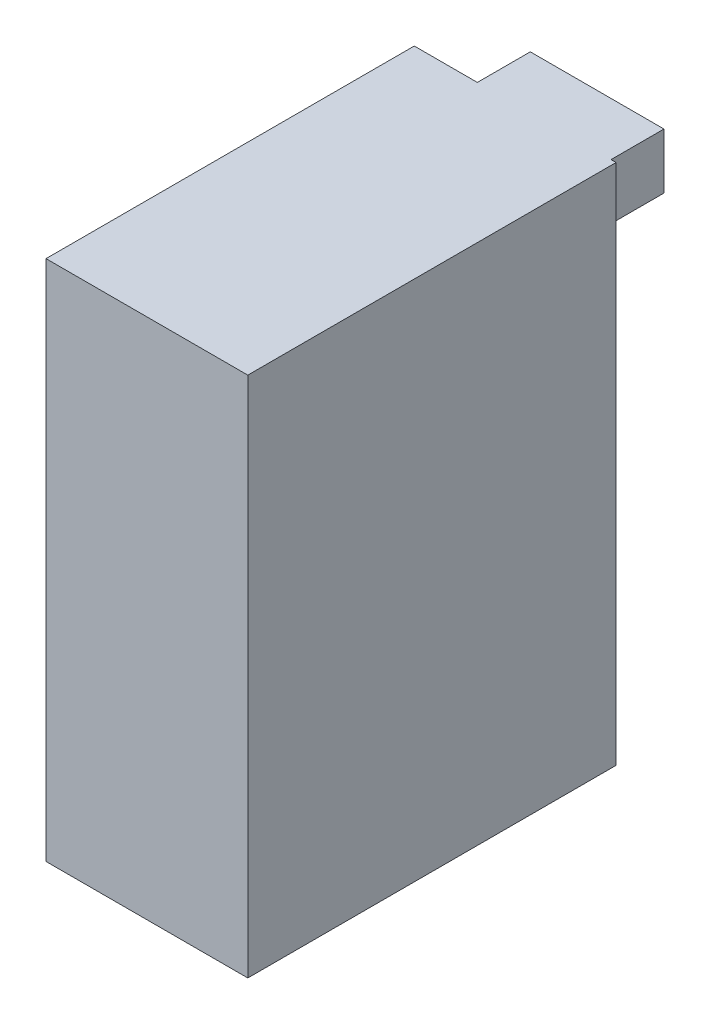
ISO-10303-21;
HEADER;
FILE_DESCRIPTION(('STEP AP214'),'2;1');
FILE_NAME('part.step','',(''),(''),'','','');
FILE_SCHEMA(('AUTOMOTIVE_DESIGN { 1 0 10303 214 1 1 1 1 }'));
ENDSEC;
DATA;
#1=APPLICATION_CONTEXT('core data for automotive mechanical design processes');
#2=APPLICATION_PROTOCOL_DEFINITION('international standard','automotive_design',2000,#1);
#3=PRODUCT_CONTEXT('',#1,'mechanical');
#4=PRODUCT('Part','Part','',(#3));
#5=PRODUCT_RELATED_PRODUCT_CATEGORY('part','',(#4));
#6=PRODUCT_DEFINITION_FORMATION('','',#4);
#7=PRODUCT_DEFINITION_CONTEXT('part definition',#1,'design');
#8=PRODUCT_DEFINITION('design','',#6,#7);
#9=PRODUCT_DEFINITION_SHAPE('','',#8);
#10=(LENGTH_UNIT() NAMED_UNIT(*) SI_UNIT(.MILLI.,.METRE.));
#11=(NAMED_UNIT(*) PLANE_ANGLE_UNIT() SI_UNIT($,.RADIAN.));
#12=(NAMED_UNIT(*) SI_UNIT($,.STERADIAN.) SOLID_ANGLE_UNIT());
#13=UNCERTAINTY_MEASURE_WITH_UNIT(LENGTH_MEASURE(1.E-05),#10,'distance_accuracy_value','');
#14=(GEOMETRIC_REPRESENTATION_CONTEXT(3) GLOBAL_UNCERTAINTY_ASSIGNED_CONTEXT((#13)) GLOBAL_UNIT_ASSIGNED_CONTEXT((#10,
#11,#12)) REPRESENTATION_CONTEXT('',''));
#15=CARTESIAN_POINT('',(0.,0.,0.));
#16=DIRECTION('',(0.,0.,1.));
#17=DIRECTION('',(1.,0.,0.));
#18=AXIS2_PLACEMENT_3D('',#15,#16,#17);
#19=CARTESIAN_POINT('',(-20.,51.75,-36.5));
#20=DIRECTION('',(0.,0.,1.));
#21=DIRECTION('',(1.,0.,0.));
#22=AXIS2_PLACEMENT_3D('',#19,#20,#21);
#23=PLANE('',#22);
#24=DIRECTION('',(0.,-1.,0.));
#25=VECTOR('',#24,1.);
#26=CARTESIAN_POINT('',(19.,51.75,-36.5));
#27=LINE('',#26,#25);
#28=CARTESIAN_POINT('',(19.,51.75,-36.5));
#29=VERTEX_POINT('',#28);
#30=CARTESIAN_POINT('',(19.,40.75,-36.5));
#31=VERTEX_POINT('',#30);
#32=EDGE_CURVE('E138',#29,#31,#27,.T.);
#33=ORIENTED_EDGE('',*,*,#32,.F.);
#34=DIRECTION('',(-1.,0.,0.));
#35=VECTOR('',#34,1.);
#36=CARTESIAN_POINT('',(-20.,51.75,-36.5));
#37=LINE('',#36,#35);
#38=CARTESIAN_POINT('',(20.,51.75,-36.5));
#39=VERTEX_POINT('',#38);
#40=EDGE_CURVE('E160',#39,#29,#37,.T.);
#41=ORIENTED_EDGE('',*,*,#40,.F.);
#42=DIRECTION('',(0.,-1.,0.));
#43=VECTOR('',#42,1.);
#44=CARTESIAN_POINT('',(20.,51.75,-36.5));
#45=LINE('',#44,#43);
#46=CARTESIAN_POINT('',(20.,-51.75,-36.5));
#47=VERTEX_POINT('',#46);
#48=EDGE_CURVE('E12',#39,#47,#45,.T.);
#49=ORIENTED_EDGE('',*,*,#48,.T.);
#50=DIRECTION('',(-1.,0.,0.));
#51=VECTOR('',#50,1.);
#52=CARTESIAN_POINT('',(-20.,-51.75,-36.5));
#53=LINE('',#52,#51);
#54=CARTESIAN_POINT('',(-20.,-51.75,-36.5));
#55=VERTEX_POINT('',#54);
#56=EDGE_CURVE('E142',#47,#55,#53,.T.);
#57=ORIENTED_EDGE('',*,*,#56,.T.);
#58=DIRECTION('',(0.,-1.,0.));
#59=VECTOR('',#58,1.);
#60=CARTESIAN_POINT('',(-20.,51.75,-36.5));
#61=LINE('',#60,#59);
#62=CARTESIAN_POINT('',(-20.,51.75,-36.5));
#63=VERTEX_POINT('',#62);
#64=EDGE_CURVE('E59',#63,#55,#61,.T.);
#65=ORIENTED_EDGE('',*,*,#64,.F.);
#66=CARTESIAN_POINT('',(-7.5,51.75,-36.5));
#67=VERTEX_POINT('',#66);
#68=EDGE_CURVE('E73',#67,#63,#37,.T.);
#69=ORIENTED_EDGE('',*,*,#68,.F.);
#70=DIRECTION('',(0.,1.,0.));
#71=VECTOR('',#70,1.);
#72=CARTESIAN_POINT('',(-7.5,51.75,-36.5));
#73=LINE('',#72,#71);
#74=CARTESIAN_POINT('',(-7.5,40.75,-36.5));
#75=VERTEX_POINT('',#74);
#76=EDGE_CURVE('E135',#75,#67,#73,.T.);
#77=ORIENTED_EDGE('',*,*,#76,.F.);
#78=DIRECTION('',(-1.,0.,0.));
#79=VECTOR('',#78,1.);
#80=CARTESIAN_POINT('',(19.,40.75,-36.5));
#81=LINE('',#80,#79);
#82=EDGE_CURVE('E67',#31,#75,#81,.T.);
#83=ORIENTED_EDGE('',*,*,#82,.F.);
#84=EDGE_LOOP('',(#33,#41,#49,#57,#65,#69,#77,#83));
#85=FACE_BOUND('',#84,.T.);
#86=ADVANCED_FACE('F50',(#85),#23,.F.);
#87=CARTESIAN_POINT('',(20.,51.75,36.5));
#88=DIRECTION('',(-1.,0.,0.));
#89=DIRECTION('',(0.,0.,1.));
#90=AXIS2_PLACEMENT_3D('',#87,#88,#89);
#91=PLANE('',#90);
#92=DIRECTION('',(0.,0.,-1.));
#93=VECTOR('',#92,1.);
#94=CARTESIAN_POINT('',(20.,-51.75,36.5));
#95=LINE('',#94,#93);
#96=CARTESIAN_POINT('',(20.,-51.75,36.5));
#97=VERTEX_POINT('',#96);
#98=EDGE_CURVE('E139',#97,#47,#95,.T.);
#99=ORIENTED_EDGE('',*,*,#98,.T.);
#100=ORIENTED_EDGE('',*,*,#48,.F.);
#101=DIRECTION('',(0.,0.,-1.));
#102=VECTOR('',#101,1.);
#103=CARTESIAN_POINT('',(20.,51.75,36.5));
#104=LINE('',#103,#102);
#105=CARTESIAN_POINT('',(20.,51.75,36.5));
#106=VERTEX_POINT('',#105);
#107=EDGE_CURVE('E148',#106,#39,#104,.T.);
#108=ORIENTED_EDGE('',*,*,#107,.F.);
#109=DIRECTION('',(0.,-1.,0.));
#110=VECTOR('',#109,1.);
#111=CARTESIAN_POINT('',(20.,51.75,36.5));
#112=LINE('',#111,#110);
#113=EDGE_CURVE('E168',#106,#97,#112,.T.);
#114=ORIENTED_EDGE('',*,*,#113,.T.);
#115=EDGE_LOOP('',(#99,#100,#108,#114));
#116=FACE_BOUND('',#115,.T.);
#117=ADVANCED_FACE('F52',(#116),#91,.F.);
#118=CARTESIAN_POINT('',(-20.,51.75,36.5));
#119=DIRECTION('',(1.,0.,0.));
#120=DIRECTION('',(0.,0.,-1.));
#121=AXIS2_PLACEMENT_3D('',#118,#119,#120);
#122=PLANE('',#121);
#123=DIRECTION('',(0.,0.,1.));
#124=VECTOR('',#123,1.);
#125=CARTESIAN_POINT('',(-20.,-51.75,36.5));
#126=LINE('',#125,#124);
#127=CARTESIAN_POINT('',(-20.,-51.75,36.5));
#128=VERTEX_POINT('',#127);
#129=EDGE_CURVE('E173',#55,#128,#126,.T.);
#130=ORIENTED_EDGE('',*,*,#129,.T.);
#131=DIRECTION('',(0.,-1.,0.));
#132=VECTOR('',#131,1.);
#133=CARTESIAN_POINT('',(-20.,51.75,36.5));
#134=LINE('',#133,#132);
#135=CARTESIAN_POINT('',(-20.,51.75,36.5));
#136=VERTEX_POINT('',#135);
#137=EDGE_CURVE('E165',#136,#128,#134,.T.);
#138=ORIENTED_EDGE('',*,*,#137,.F.);
#139=DIRECTION('',(0.,0.,1.));
#140=VECTOR('',#139,1.);
#141=CARTESIAN_POINT('',(-20.,51.75,36.5));
#142=LINE('',#141,#140);
#143=EDGE_CURVE('E154',#63,#136,#142,.T.);
#144=ORIENTED_EDGE('',*,*,#143,.F.);
#145=ORIENTED_EDGE('',*,*,#64,.T.);
#146=EDGE_LOOP('',(#130,#138,#144,#145));
#147=FACE_BOUND('',#146,.T.);
#148=ADVANCED_FACE('F183',(#147),#122,.F.);
#149=CARTESIAN_POINT('',(-20.,51.75,36.5));
#150=DIRECTION('',(0.,0.,-1.));
#151=DIRECTION('',(-1.,0.,0.));
#152=AXIS2_PLACEMENT_3D('',#149,#150,#151);
#153=PLANE('',#152);
#154=DIRECTION('',(1.,0.,0.));
#155=VECTOR('',#154,1.);
#156=CARTESIAN_POINT('',(-20.,-51.75,36.5));
#157=LINE('',#156,#155);
#158=EDGE_CURVE('E151',#128,#97,#157,.T.);
#159=ORIENTED_EDGE('',*,*,#158,.T.);
#160=ORIENTED_EDGE('',*,*,#113,.F.);
#161=DIRECTION('',(1.,0.,0.));
#162=VECTOR('',#161,1.);
#163=CARTESIAN_POINT('',(-20.,51.75,36.5));
#164=LINE('',#163,#162);
#165=EDGE_CURVE('E171',#136,#106,#164,.T.);
#166=ORIENTED_EDGE('',*,*,#165,.F.);
#167=ORIENTED_EDGE('',*,*,#137,.T.);
#168=EDGE_LOOP('',(#159,#160,#166,#167));
#169=FACE_BOUND('',#168,.T.);
#170=ADVANCED_FACE('F187',(#169),#153,.F.);
#171=CARTESIAN_POINT('',(0.,51.75,0.));
#172=DIRECTION('',(0.,-1.,0.));
#173=DIRECTION('',(0.,0.,-1.));
#174=AXIS2_PLACEMENT_3D('',#171,#172,#173);
#175=PLANE('',#174);
#176=ORIENTED_EDGE('',*,*,#107,.T.);
#177=ORIENTED_EDGE('',*,*,#40,.T.);
#178=DIRECTION('',(0.,0.,1.));
#179=VECTOR('',#178,1.);
#180=CARTESIAN_POINT('',(19.,51.75,-47.));
#181=LINE('',#180,#179);
#182=CARTESIAN_POINT('',(19.,51.75,-47.));
#183=VERTEX_POINT('',#182);
#184=EDGE_CURVE('E192',#183,#29,#181,.T.);
#185=ORIENTED_EDGE('',*,*,#184,.F.);
#186=DIRECTION('',(1.,0.,0.));
#187=VECTOR('',#186,1.);
#188=CARTESIAN_POINT('',(19.,51.75,-47.));
#189=LINE('',#188,#187);
#190=CARTESIAN_POINT('',(-7.5,51.75,-47.));
#191=VERTEX_POINT('',#190);
#192=EDGE_CURVE('E131',#191,#183,#189,.T.);
#193=ORIENTED_EDGE('',*,*,#192,.F.);
#194=DIRECTION('',(0.,0.,1.));
#195=VECTOR('',#194,1.);
#196=CARTESIAN_POINT('',(-7.5,51.75,-47.));
#197=LINE('',#196,#195);
#198=EDGE_CURVE('E144',#191,#67,#197,.T.);
#199=ORIENTED_EDGE('',*,*,#198,.T.);
#200=ORIENTED_EDGE('',*,*,#68,.T.);
#201=ORIENTED_EDGE('',*,*,#143,.T.);
#202=ORIENTED_EDGE('',*,*,#165,.T.);
#203=EDGE_LOOP('',(#176,#177,#185,#193,#199,#200,#201,#202));
#204=FACE_BOUND('',#203,.T.);
#205=ADVANCED_FACE('F180',(#204),#175,.F.);
#206=CARTESIAN_POINT('',(0.,-51.75,0.));
#207=DIRECTION('',(0.,-1.,0.));
#208=DIRECTION('',(0.,0.,-1.));
#209=AXIS2_PLACEMENT_3D('',#206,#207,#208);
#210=PLANE('',#209);
#211=ORIENTED_EDGE('',*,*,#98,.F.);
#212=ORIENTED_EDGE('',*,*,#158,.F.);
#213=ORIENTED_EDGE('',*,*,#129,.F.);
#214=ORIENTED_EDGE('',*,*,#56,.F.);
#215=EDGE_LOOP('',(#211,#212,#213,#214));
#216=FACE_BOUND('',#215,.T.);
#217=ADVANCED_FACE('F215',(#216),#210,.T.);
#218=CARTESIAN_POINT('',(19.,51.75,-47.));
#219=DIRECTION('',(-1.,0.,0.));
#220=DIRECTION('',(0.,-1.,0.));
#221=AXIS2_PLACEMENT_3D('',#218,#219,#220);
#222=PLANE('',#221);
#223=ORIENTED_EDGE('',*,*,#32,.T.);
#224=DIRECTION('',(0.,0.,1.));
#225=VECTOR('',#224,1.);
#226=CARTESIAN_POINT('',(19.,40.75,-47.));
#227=LINE('',#226,#225);
#228=CARTESIAN_POINT('',(19.,40.75,-47.));
#229=VERTEX_POINT('',#228);
#230=EDGE_CURVE('E119',#229,#31,#227,.T.);
#231=ORIENTED_EDGE('',*,*,#230,.F.);
#232=DIRECTION('',(0.,-1.,0.));
#233=VECTOR('',#232,1.);
#234=CARTESIAN_POINT('',(19.,51.75,-47.));
#235=LINE('',#234,#233);
#236=EDGE_CURVE('E126',#183,#229,#235,.T.);
#237=ORIENTED_EDGE('',*,*,#236,.F.);
#238=ORIENTED_EDGE('',*,*,#184,.T.);
#239=EDGE_LOOP('',(#223,#231,#237,#238));
#240=FACE_BOUND('',#239,.T.);
#241=ADVANCED_FACE('F137',(#240),#222,.F.);
#242=CARTESIAN_POINT('',(19.,40.75,-47.));
#243=DIRECTION('',(0.,1.,0.));
#244=DIRECTION('',(-1.,0.,0.));
#245=AXIS2_PLACEMENT_3D('',#242,#243,#244);
#246=PLANE('',#245);
#247=ORIENTED_EDGE('',*,*,#82,.T.);
#248=DIRECTION('',(0.,0.,1.));
#249=VECTOR('',#248,1.);
#250=CARTESIAN_POINT('',(-7.5,40.75,-47.));
#251=LINE('',#250,#249);
#252=CARTESIAN_POINT('',(-7.5,40.75,-47.));
#253=VERTEX_POINT('',#252);
#254=EDGE_CURVE('E122',#253,#75,#251,.T.);
#255=ORIENTED_EDGE('',*,*,#254,.F.);
#256=DIRECTION('',(-1.,0.,0.));
#257=VECTOR('',#256,1.);
#258=CARTESIAN_POINT('',(19.,40.75,-47.));
#259=LINE('',#258,#257);
#260=EDGE_CURVE('E115',#229,#253,#259,.T.);
#261=ORIENTED_EDGE('',*,*,#260,.F.);
#262=ORIENTED_EDGE('',*,*,#230,.T.);
#263=EDGE_LOOP('',(#247,#255,#261,#262));
#264=FACE_BOUND('',#263,.T.);
#265=ADVANCED_FACE('F117',(#264),#246,.F.);
#266=CARTESIAN_POINT('',(-7.5,51.75,-47.));
#267=DIRECTION('',(1.,0.,0.));
#268=DIRECTION('',(0.,1.,0.));
#269=AXIS2_PLACEMENT_3D('',#266,#267,#268);
#270=PLANE('',#269);
#271=ORIENTED_EDGE('',*,*,#76,.T.);
#272=ORIENTED_EDGE('',*,*,#198,.F.);
#273=DIRECTION('',(0.,1.,0.));
#274=VECTOR('',#273,1.);
#275=CARTESIAN_POINT('',(-7.5,51.75,-47.));
#276=LINE('',#275,#274);
#277=EDGE_CURVE('E125',#253,#191,#276,.T.);
#278=ORIENTED_EDGE('',*,*,#277,.F.);
#279=ORIENTED_EDGE('',*,*,#254,.T.);
#280=EDGE_LOOP('',(#271,#272,#278,#279));
#281=FACE_BOUND('',#280,.T.);
#282=ADVANCED_FACE('F205',(#281),#270,.F.);
#283=CARTESIAN_POINT('',(0.,0.,-47.));
#284=DIRECTION('',(0.,0.,-1.));
#285=DIRECTION('',(-1.,0.,0.));
#286=AXIS2_PLACEMENT_3D('',#283,#284,#285);
#287=PLANE('',#286);
#288=ORIENTED_EDGE('',*,*,#236,.T.);
#289=ORIENTED_EDGE('',*,*,#260,.T.);
#290=ORIENTED_EDGE('',*,*,#277,.T.);
#291=ORIENTED_EDGE('',*,*,#192,.T.);
#292=EDGE_LOOP('',(#288,#289,#290,#291));
#293=FACE_BOUND('',#292,.T.);
#294=ADVANCED_FACE('F129',(#293),#287,.T.);
#295=CLOSED_SHELL('',(#86,#117,#148,#170,#205,#217,#241,#265,#282,#294));
#296=MANIFOLD_SOLID_BREP('B2',#295);
#297=ADVANCED_BREP_SHAPE_REPRESENTATION('',(#18,#296),#14);
#298=SHAPE_DEFINITION_REPRESENTATION(#9,#297);
ENDSEC;
END-ISO-10303-21;
